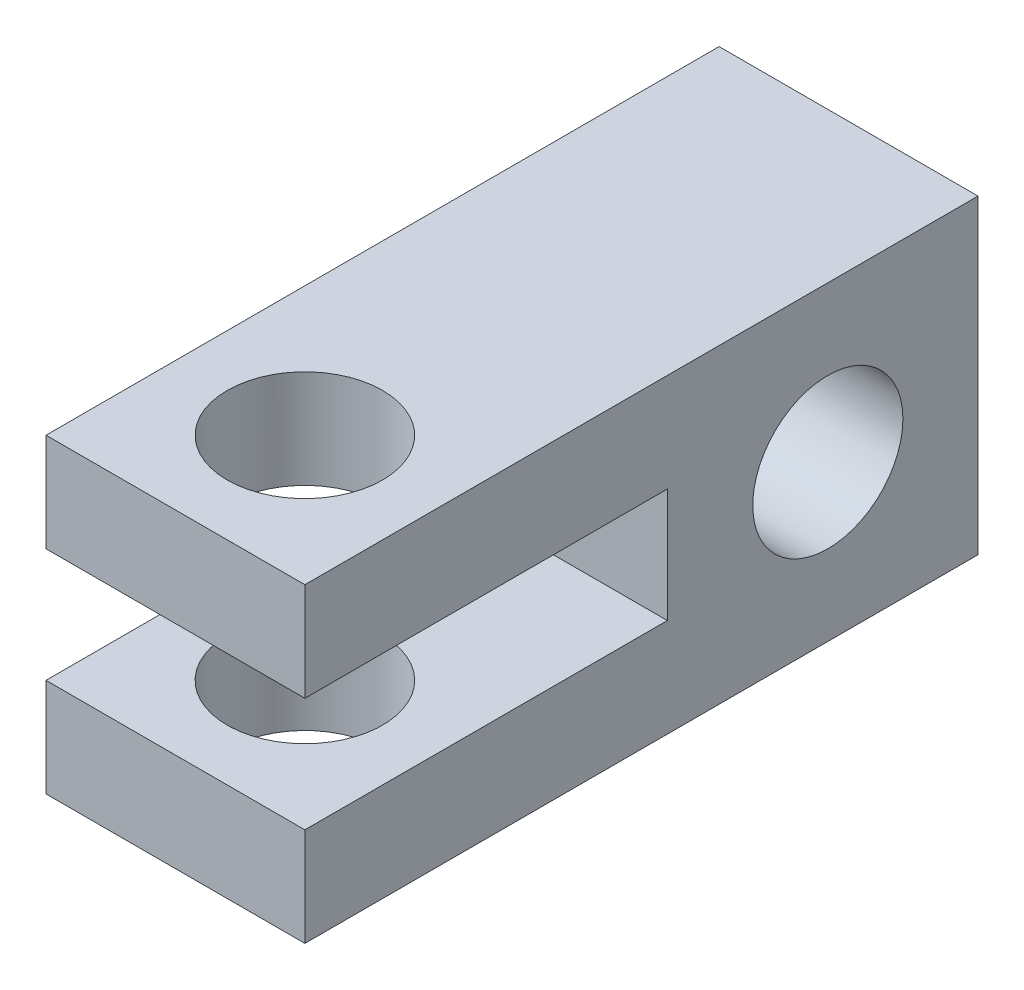
ISO-10303-21;
HEADER;
FILE_DESCRIPTION(('STEP AP214'),'2;1');
FILE_NAME('part.step','',(''),(''),'','','');
FILE_SCHEMA(('AUTOMOTIVE_DESIGN { 1 0 10303 214 1 1 1 1 }'));
ENDSEC;
DATA;
#1=APPLICATION_CONTEXT('core data for automotive mechanical design processes');
#2=APPLICATION_PROTOCOL_DEFINITION('international standard','automotive_design',2000,#1);
#3=PRODUCT_CONTEXT('',#1,'mechanical');
#4=PRODUCT('Part','Part','',(#3));
#5=PRODUCT_RELATED_PRODUCT_CATEGORY('part','',(#4));
#6=PRODUCT_DEFINITION_FORMATION('','',#4);
#7=PRODUCT_DEFINITION_CONTEXT('part definition',#1,'design');
#8=PRODUCT_DEFINITION('design','',#6,#7);
#9=PRODUCT_DEFINITION_SHAPE('','',#8);
#10=(LENGTH_UNIT() NAMED_UNIT(*) SI_UNIT(.MILLI.,.METRE.));
#11=(NAMED_UNIT(*) PLANE_ANGLE_UNIT() SI_UNIT($,.RADIAN.));
#12=(NAMED_UNIT(*) SI_UNIT($,.STERADIAN.) SOLID_ANGLE_UNIT());
#13=UNCERTAINTY_MEASURE_WITH_UNIT(LENGTH_MEASURE(1.E-05),#10,'distance_accuracy_value','');
#14=(GEOMETRIC_REPRESENTATION_CONTEXT(3) GLOBAL_UNCERTAINTY_ASSIGNED_CONTEXT((#13)) GLOBAL_UNIT_ASSIGNED_CONTEXT((#10,
#11,#12)) REPRESENTATION_CONTEXT('',''));
#15=CARTESIAN_POINT('',(0.,0.,0.));
#16=DIRECTION('',(0.,0.,1.));
#17=DIRECTION('',(1.,0.,0.));
#18=AXIS2_PLACEMENT_3D('',#15,#16,#17);
#19=CARTESIAN_POINT('',(0.,7.62,0.));
#20=DIRECTION('',(1.,0.,0.));
#21=DIRECTION('',(0.,0.,-1.));
#22=AXIS2_PLACEMENT_3D('',#19,#20,#21);
#23=PLANE('',#22);
#24=CARTESIAN_POINT('',(0.,3.81,-12.827));
#25=DIRECTION('',(1.,0.,0.));
#26=DIRECTION('',(0.,0.,-1.));
#27=AXIS2_PLACEMENT_3D('',#24,#25,#26);
#28=CIRCLE('',#27,1.8415);
#29=CARTESIAN_POINT('',(0.,3.81,-14.6685));
#30=VERTEX_POINT('',#29);
#31=EDGE_CURVE('E138',#30,#30,#28,.T.);
#32=ORIENTED_EDGE('',*,*,#31,.T.);
#33=EDGE_LOOP('',(#32));
#34=FACE_BOUND('',#33,.T.);
#35=DIRECTION('',(0.,0.,-1.));
#36=VECTOR('',#35,1.);
#37=CARTESIAN_POINT('',(0.,2.413,1.2E-05));
#38=LINE('',#37,#36);
#39=CARTESIAN_POINT('',(0.,2.413,0.));
#40=VERTEX_POINT('',#39);
#41=CARTESIAN_POINT('',(0.,2.413,-8.89));
#42=VERTEX_POINT('',#41);
#43=EDGE_CURVE('E121',#40,#42,#38,.T.);
#44=ORIENTED_EDGE('',*,*,#43,.T.);
#45=DIRECTION('',(0.,-1.,0.));
#46=VECTOR('',#45,1.);
#47=CARTESIAN_POINT('',(0.,2.413,-8.89));
#48=LINE('',#47,#46);
#49=CARTESIAN_POINT('',(0.,5.207,-8.89));
#50=VERTEX_POINT('',#49);
#51=EDGE_CURVE('E128',#50,#42,#48,.T.);
#52=ORIENTED_EDGE('',*,*,#51,.F.);
#53=DIRECTION('',(0.,0.,-1.));
#54=VECTOR('',#53,1.);
#55=CARTESIAN_POINT('',(0.,5.207,1.2E-05));
#56=LINE('',#55,#54);
#57=CARTESIAN_POINT('',(0.,5.207,0.));
#58=VERTEX_POINT('',#57);
#59=EDGE_CURVE('E223',#58,#50,#56,.T.);
#60=ORIENTED_EDGE('',*,*,#59,.F.);
#61=DIRECTION('',(0.,-1.,0.));
#62=VECTOR('',#61,1.);
#63=CARTESIAN_POINT('',(0.,7.62,0.));
#64=LINE('',#63,#62);
#65=CARTESIAN_POINT('',(0.,7.62,0.));
#66=VERTEX_POINT('',#65);
#67=EDGE_CURVE('E11',#66,#58,#64,.T.);
#68=ORIENTED_EDGE('',*,*,#67,.F.);
#69=DIRECTION('',(0.,0.,1.));
#70=VECTOR('',#69,1.);
#71=CARTESIAN_POINT('',(0.,7.62,0.));
#72=LINE('',#71,#70);
#73=CARTESIAN_POINT('',(0.,7.62,-16.51));
#74=VERTEX_POINT('',#73);
#75=EDGE_CURVE('E167',#74,#66,#72,.T.);
#76=ORIENTED_EDGE('',*,*,#75,.F.);
#77=DIRECTION('',(0.,-1.,0.));
#78=VECTOR('',#77,1.);
#79=CARTESIAN_POINT('',(0.,7.62,-16.51));
#80=LINE('',#79,#78);
#81=CARTESIAN_POINT('',(0.,0.,-16.51));
#82=VERTEX_POINT('',#81);
#83=EDGE_CURVE('E177',#74,#82,#80,.T.);
#84=ORIENTED_EDGE('',*,*,#83,.T.);
#85=DIRECTION('',(0.,0.,1.));
#86=VECTOR('',#85,1.);
#87=CARTESIAN_POINT('',(0.,0.,0.));
#88=LINE('',#87,#86);
#89=CARTESIAN_POINT('',(0.,0.,0.));
#90=VERTEX_POINT('',#89);
#91=EDGE_CURVE('E163',#82,#90,#88,.T.);
#92=ORIENTED_EDGE('',*,*,#91,.T.);
#93=EDGE_CURVE('E54',#40,#90,#64,.T.);
#94=ORIENTED_EDGE('',*,*,#93,.F.);
#95=EDGE_LOOP('',(#44,#52,#60,#68,#76,#84,#92,#94));
#96=FACE_BOUND('',#95,.T.);
#97=ADVANCED_FACE('F45',(#34,#96),#23,.F.);
#98=CARTESIAN_POINT('',(0.,7.62,0.));
#99=DIRECTION('',(0.,0.,-1.));
#100=DIRECTION('',(-1.,0.,0.));
#101=AXIS2_PLACEMENT_3D('',#98,#99,#100);
#102=PLANE('',#101);
#103=DIRECTION('',(1.,0.,0.));
#104=VECTOR('',#103,1.);
#105=CARTESIAN_POINT('',(0.,2.413,0.));
#106=LINE('',#105,#104);
#107=CARTESIAN_POINT('',(6.35,2.413,0.));
#108=VERTEX_POINT('',#107);
#109=EDGE_CURVE('E155',#40,#108,#106,.T.);
#110=ORIENTED_EDGE('',*,*,#109,.F.);
#111=ORIENTED_EDGE('',*,*,#93,.T.);
#112=DIRECTION('',(1.,0.,0.));
#113=VECTOR('',#112,1.);
#114=CARTESIAN_POINT('',(0.,0.,0.));
#115=LINE('',#114,#113);
#116=CARTESIAN_POINT('',(6.35,0.,0.));
#117=VERTEX_POINT('',#116);
#118=EDGE_CURVE('E180',#90,#117,#115,.T.);
#119=ORIENTED_EDGE('',*,*,#118,.T.);
#120=DIRECTION('',(0.,-1.,0.));
#121=VECTOR('',#120,1.);
#122=CARTESIAN_POINT('',(6.35,7.62,0.));
#123=LINE('',#122,#121);
#124=EDGE_CURVE('E194',#108,#117,#123,.T.);
#125=ORIENTED_EDGE('',*,*,#124,.F.);
#126=EDGE_LOOP('',(#110,#111,#119,#125));
#127=FACE_BOUND('',#126,.T.);
#128=ADVANCED_FACE('F209',(#127),#102,.F.);
#129=DIRECTION('',(-1.,0.,0.));
#130=VECTOR('',#129,1.);
#131=CARTESIAN_POINT('',(0.,5.207,0.));
#132=LINE('',#131,#130);
#133=CARTESIAN_POINT('',(6.35,5.207,0.));
#134=VERTEX_POINT('',#133);
#135=EDGE_CURVE('E148',#134,#58,#132,.T.);
#136=ORIENTED_EDGE('',*,*,#135,.F.);
#137=CARTESIAN_POINT('',(6.35,7.62,0.));
#138=VERTEX_POINT('',#137);
#139=EDGE_CURVE('E195',#138,#134,#123,.T.);
#140=ORIENTED_EDGE('',*,*,#139,.F.);
#141=DIRECTION('',(1.,0.,0.));
#142=VECTOR('',#141,1.);
#143=CARTESIAN_POINT('',(0.,7.62,0.));
#144=LINE('',#143,#142);
#145=EDGE_CURVE('E99',#66,#138,#144,.T.);
#146=ORIENTED_EDGE('',*,*,#145,.F.);
#147=ORIENTED_EDGE('',*,*,#67,.T.);
#148=EDGE_LOOP('',(#136,#140,#146,#147));
#149=FACE_BOUND('',#148,.T.);
#150=ADVANCED_FACE('F220',(#149),#102,.F.);
#151=CARTESIAN_POINT('',(6.35,7.62,0.));
#152=DIRECTION('',(-1.,0.,0.));
#153=DIRECTION('',(0.,0.,1.));
#154=AXIS2_PLACEMENT_3D('',#151,#152,#153);
#155=PLANE('',#154);
#156=CARTESIAN_POINT('',(6.35,3.81,-12.827));
#157=DIRECTION('',(1.,0.,0.));
#158=DIRECTION('',(0.,0.,-1.));
#159=AXIS2_PLACEMENT_3D('',#156,#157,#158);
#160=CIRCLE('',#159,1.8415);
#161=CARTESIAN_POINT('',(6.35,3.81,-14.6685));
#162=VERTEX_POINT('',#161);
#163=EDGE_CURVE('E232',#162,#162,#160,.T.);
#164=ORIENTED_EDGE('',*,*,#163,.F.);
#165=EDGE_LOOP('',(#164));
#166=FACE_BOUND('',#165,.T.);
#167=DIRECTION('',(0.,0.,-1.));
#168=VECTOR('',#167,1.);
#169=CARTESIAN_POINT('',(6.35,2.413,1.2E-05));
#170=LINE('',#169,#168);
#171=CARTESIAN_POINT('',(6.35,2.413,-8.89));
#172=VERTEX_POINT('',#171);
#173=EDGE_CURVE('E124',#108,#172,#170,.T.);
#174=ORIENTED_EDGE('',*,*,#173,.F.);
#175=ORIENTED_EDGE('',*,*,#124,.T.);
#176=DIRECTION('',(0.,0.,-1.));
#177=VECTOR('',#176,1.);
#178=CARTESIAN_POINT('',(6.35,0.,0.));
#179=LINE('',#178,#177);
#180=CARTESIAN_POINT('',(6.35,0.,-16.51));
#181=VERTEX_POINT('',#180);
#182=EDGE_CURVE('E184',#117,#181,#179,.T.);
#183=ORIENTED_EDGE('',*,*,#182,.T.);
#184=DIRECTION('',(0.,-1.,0.));
#185=VECTOR('',#184,1.);
#186=CARTESIAN_POINT('',(6.35,7.62,-16.51));
#187=LINE('',#186,#185);
#188=CARTESIAN_POINT('',(6.35,7.62,-16.51));
#189=VERTEX_POINT('',#188);
#190=EDGE_CURVE('E191',#189,#181,#187,.T.);
#191=ORIENTED_EDGE('',*,*,#190,.F.);
#192=DIRECTION('',(0.,0.,-1.));
#193=VECTOR('',#192,1.);
#194=CARTESIAN_POINT('',(6.35,7.62,0.));
#195=LINE('',#194,#193);
#196=EDGE_CURVE('E172',#138,#189,#195,.T.);
#197=ORIENTED_EDGE('',*,*,#196,.F.);
#198=ORIENTED_EDGE('',*,*,#139,.T.);
#199=DIRECTION('',(0.,0.,-1.));
#200=VECTOR('',#199,1.);
#201=CARTESIAN_POINT('',(6.35,5.207,1.2E-05));
#202=LINE('',#201,#200);
#203=CARTESIAN_POINT('',(6.35,5.207,-8.89));
#204=VERTEX_POINT('',#203);
#205=EDGE_CURVE('E149',#134,#204,#202,.T.);
#206=ORIENTED_EDGE('',*,*,#205,.T.);
#207=DIRECTION('',(0.,1.,0.));
#208=VECTOR('',#207,1.);
#209=CARTESIAN_POINT('',(6.35,2.413,-8.89));
#210=LINE('',#209,#208);
#211=EDGE_CURVE('E127',#172,#204,#210,.T.);
#212=ORIENTED_EDGE('',*,*,#211,.F.);
#213=EDGE_LOOP('',(#174,#175,#183,#191,#197,#198,#206,#212));
#214=FACE_BOUND('',#213,.T.);
#215=ADVANCED_FACE('F204',(#166,#214),#155,.F.);
#216=CARTESIAN_POINT('',(3.175,7.62,-3.175));
#217=DIRECTION('',(0.,-1.,0.));
#218=DIRECTION('',(0.,0.,-1.));
#219=AXIS2_PLACEMENT_3D('',#216,#217,#218);
#220=CYLINDRICAL_SURFACE('',#219,1.905);
#221=CARTESIAN_POINT('',(3.175,0.,-3.175));
#222=DIRECTION('',(0.,1.,0.));
#223=DIRECTION('',(0.,0.,1.));
#224=AXIS2_PLACEMENT_3D('',#221,#222,#223);
#225=CIRCLE('',#224,1.905);
#226=CARTESIAN_POINT('',(3.175,0.,-1.27));
#227=VERTEX_POINT('',#226);
#228=EDGE_CURVE('E158',#227,#227,#225,.T.);
#229=ORIENTED_EDGE('',*,*,#228,.F.);
#230=EDGE_LOOP('',(#229));
#231=FACE_BOUND('',#230,.T.);
#232=CARTESIAN_POINT('',(3.175,2.413,-3.175));
#233=DIRECTION('',(0.,1.,0.));
#234=DIRECTION('',(-1.,0.,0.));
#235=AXIS2_PLACEMENT_3D('',#232,#233,#234);
#236=CIRCLE('',#235,1.905);
#237=CARTESIAN_POINT('',(1.27,2.413,-3.175));
#238=VERTEX_POINT('',#237);
#239=EDGE_CURVE('E48',#238,#238,#236,.T.);
#240=ORIENTED_EDGE('',*,*,#239,.T.);
#241=EDGE_LOOP('',(#240));
#242=FACE_BOUND('',#241,.T.);
#243=ADVANCED_FACE('F248',(#231,#242),#220,.F.);
#244=CARTESIAN_POINT('',(3.175,7.62,-3.175));
#245=DIRECTION('',(0.,1.,0.));
#246=DIRECTION('',(0.,0.,1.));
#247=AXIS2_PLACEMENT_3D('',#244,#245,#246);
#248=CIRCLE('',#247,1.905);
#249=CARTESIAN_POINT('',(3.175,7.62,-1.27));
#250=VERTEX_POINT('',#249);
#251=EDGE_CURVE('E159',#250,#250,#248,.T.);
#252=ORIENTED_EDGE('',*,*,#251,.T.);
#253=EDGE_LOOP('',(#252));
#254=FACE_BOUND('',#253,.T.);
#255=CARTESIAN_POINT('',(3.175,5.207,-3.175));
#256=DIRECTION('',(0.,-1.,0.));
#257=DIRECTION('',(0.,0.,-1.));
#258=AXIS2_PLACEMENT_3D('',#255,#256,#257);
#259=CIRCLE('',#258,1.905);
#260=CARTESIAN_POINT('',(3.175,5.207,-5.08));
#261=VERTEX_POINT('',#260);
#262=EDGE_CURVE('E143',#261,#261,#259,.T.);
#263=ORIENTED_EDGE('',*,*,#262,.T.);
#264=EDGE_LOOP('',(#263));
#265=FACE_BOUND('',#264,.T.);
#266=ADVANCED_FACE('F254',(#254,#265),#220,.F.);
#267=CARTESIAN_POINT('',(0.,7.62,0.));
#268=DIRECTION('',(0.,-1.,0.));
#269=DIRECTION('',(0.,0.,-1.));
#270=AXIS2_PLACEMENT_3D('',#267,#268,#269);
#271=PLANE('',#270);
#272=ORIENTED_EDGE('',*,*,#75,.T.);
#273=ORIENTED_EDGE('',*,*,#145,.T.);
#274=ORIENTED_EDGE('',*,*,#196,.T.);
#275=DIRECTION('',(-1.,0.,0.));
#276=VECTOR('',#275,1.);
#277=CARTESIAN_POINT('',(0.,7.62,-16.51));
#278=LINE('',#277,#276);
#279=EDGE_CURVE('E71',#189,#74,#278,.T.);
#280=ORIENTED_EDGE('',*,*,#279,.T.);
#281=EDGE_LOOP('',(#272,#273,#274,#280));
#282=FACE_BOUND('',#281,.T.);
#283=ORIENTED_EDGE('',*,*,#251,.F.);
#284=EDGE_LOOP('',(#283));
#285=FACE_BOUND('',#284,.T.);
#286=ADVANCED_FACE('F217',(#282,#285),#271,.F.);
#287=CARTESIAN_POINT('',(0.,0.,0.));
#288=DIRECTION('',(0.,-1.,0.));
#289=DIRECTION('',(0.,0.,-1.));
#290=AXIS2_PLACEMENT_3D('',#287,#288,#289);
#291=PLANE('',#290);
#292=ORIENTED_EDGE('',*,*,#91,.F.);
#293=DIRECTION('',(-1.,0.,0.));
#294=VECTOR('',#293,1.);
#295=CARTESIAN_POINT('',(0.,0.,-16.51));
#296=LINE('',#295,#294);
#297=EDGE_CURVE('E92',#181,#82,#296,.T.);
#298=ORIENTED_EDGE('',*,*,#297,.F.);
#299=ORIENTED_EDGE('',*,*,#182,.F.);
#300=ORIENTED_EDGE('',*,*,#118,.F.);
#301=EDGE_LOOP('',(#292,#298,#299,#300));
#302=FACE_BOUND('',#301,.T.);
#303=ORIENTED_EDGE('',*,*,#228,.T.);
#304=EDGE_LOOP('',(#303));
#305=FACE_BOUND('',#304,.T.);
#306=ADVANCED_FACE('F212',(#302,#305),#291,.T.);
#307=CARTESIAN_POINT('',(0.,7.62,-16.51));
#308=DIRECTION('',(0.,0.,1.));
#309=DIRECTION('',(1.,0.,0.));
#310=AXIS2_PLACEMENT_3D('',#307,#308,#309);
#311=PLANE('',#310);
#312=ORIENTED_EDGE('',*,*,#297,.T.);
#313=ORIENTED_EDGE('',*,*,#83,.F.);
#314=ORIENTED_EDGE('',*,*,#279,.F.);
#315=ORIENTED_EDGE('',*,*,#190,.T.);
#316=EDGE_LOOP('',(#312,#313,#314,#315));
#317=FACE_BOUND('',#316,.T.);
#318=ADVANCED_FACE('F216',(#317),#311,.F.);
#319=CARTESIAN_POINT('',(0.,2.413,1.2E-05));
#320=DIRECTION('',(0.,1.,0.));
#321=DIRECTION('',(-1.,0.,0.));
#322=AXIS2_PLACEMENT_3D('',#319,#320,#321);
#323=PLANE('',#322);
#324=ORIENTED_EDGE('',*,*,#239,.F.);
#325=EDGE_LOOP('',(#324));
#326=FACE_BOUND('',#325,.T.);
#327=ORIENTED_EDGE('',*,*,#109,.T.);
#328=ORIENTED_EDGE('',*,*,#173,.T.);
#329=DIRECTION('',(1.,0.,0.));
#330=VECTOR('',#329,1.);
#331=CARTESIAN_POINT('',(0.,2.413,-8.89));
#332=LINE('',#331,#330);
#333=EDGE_CURVE('E62',#42,#172,#332,.T.);
#334=ORIENTED_EDGE('',*,*,#333,.F.);
#335=ORIENTED_EDGE('',*,*,#43,.F.);
#336=EDGE_LOOP('',(#327,#328,#334,#335));
#337=FACE_BOUND('',#336,.T.);
#338=ADVANCED_FACE('F119',(#326,#337),#323,.T.);
#339=CARTESIAN_POINT('',(0.,5.207,1.2E-05));
#340=DIRECTION('',(0.,-1.,0.));
#341=DIRECTION('',(0.,0.,-1.));
#342=AXIS2_PLACEMENT_3D('',#339,#340,#341);
#343=PLANE('',#342);
#344=ORIENTED_EDGE('',*,*,#262,.F.);
#345=EDGE_LOOP('',(#344));
#346=FACE_BOUND('',#345,.T.);
#347=ORIENTED_EDGE('',*,*,#135,.T.);
#348=ORIENTED_EDGE('',*,*,#59,.T.);
#349=DIRECTION('',(-1.,0.,0.));
#350=VECTOR('',#349,1.);
#351=CARTESIAN_POINT('',(0.,5.207,-8.89));
#352=LINE('',#351,#350);
#353=EDGE_CURVE('E134',#204,#50,#352,.T.);
#354=ORIENTED_EDGE('',*,*,#353,.F.);
#355=ORIENTED_EDGE('',*,*,#205,.F.);
#356=EDGE_LOOP('',(#347,#348,#354,#355));
#357=FACE_BOUND('',#356,.T.);
#358=ADVANCED_FACE('F222',(#346,#357),#343,.T.);
#359=CARTESIAN_POINT('',(0.,0.,-8.89));
#360=DIRECTION('',(0.,0.,-1.));
#361=DIRECTION('',(-1.,0.,0.));
#362=AXIS2_PLACEMENT_3D('',#359,#360,#361);
#363=PLANE('',#362);
#364=ORIENTED_EDGE('',*,*,#51,.T.);
#365=ORIENTED_EDGE('',*,*,#333,.T.);
#366=ORIENTED_EDGE('',*,*,#211,.T.);
#367=ORIENTED_EDGE('',*,*,#353,.T.);
#368=EDGE_LOOP('',(#364,#365,#366,#367));
#369=FACE_BOUND('',#368,.T.);
#370=ADVANCED_FACE('F132',(#369),#363,.F.);
#371=CARTESIAN_POINT('',(0.,3.81,-12.827));
#372=DIRECTION('',(1.,0.,0.));
#373=DIRECTION('',(0.,0.,-1.));
#374=AXIS2_PLACEMENT_3D('',#371,#372,#373);
#375=CYLINDRICAL_SURFACE('',#374,1.8415);
#376=ORIENTED_EDGE('',*,*,#31,.F.);
#377=EDGE_LOOP('',(#376));
#378=FACE_BOUND('',#377,.T.);
#379=ORIENTED_EDGE('',*,*,#163,.T.);
#380=EDGE_LOOP('',(#379));
#381=FACE_BOUND('',#380,.T.);
#382=ADVANCED_FACE('F241',(#378,#381),#375,.F.);
#383=CLOSED_SHELL('',(#97,#128,#150,#215,#243,#266,#286,#306,#318,#338,#358,#370,#382));
#384=MANIFOLD_SOLID_BREP('B2',#383);
#385=ADVANCED_BREP_SHAPE_REPRESENTATION('',(#18,#384),#14);
#386=SHAPE_DEFINITION_REPRESENTATION(#9,#385);
ENDSEC;
END-ISO-10303-21;
